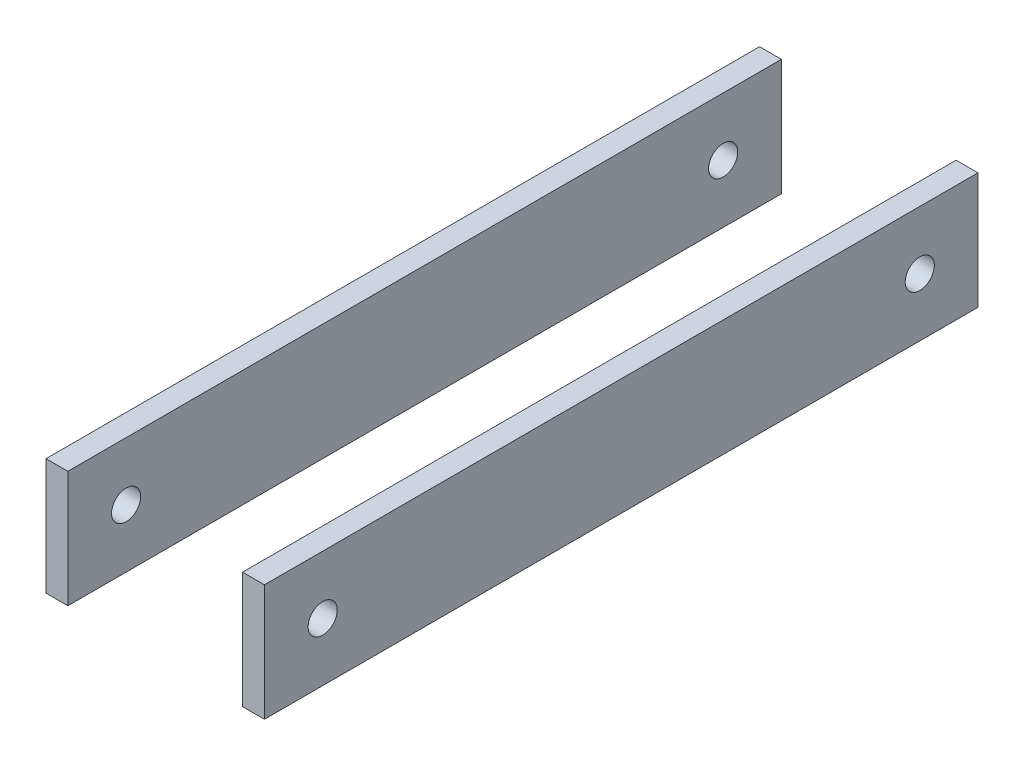
ISO-10303-21;
HEADER;
FILE_DESCRIPTION(('STEP AP214'),'2;1');
FILE_NAME('part.step','',(''),(''),'','','');
FILE_SCHEMA(('AUTOMOTIVE_DESIGN { 1 0 10303 214 1 1 1 1 }'));
ENDSEC;
DATA;
#1=APPLICATION_CONTEXT('core data for automotive mechanical design processes');
#2=APPLICATION_PROTOCOL_DEFINITION('international standard','automotive_design',2000,#1);
#3=PRODUCT_CONTEXT('',#1,'mechanical');
#4=PRODUCT('Part','Part','',(#3));
#5=PRODUCT_RELATED_PRODUCT_CATEGORY('part','',(#4));
#6=PRODUCT_DEFINITION_FORMATION('','',#4);
#7=PRODUCT_DEFINITION_CONTEXT('part definition',#1,'design');
#8=PRODUCT_DEFINITION('design','',#6,#7);
#9=PRODUCT_DEFINITION_SHAPE('','',#8);
#10=(LENGTH_UNIT() NAMED_UNIT(*) SI_UNIT(.MILLI.,.METRE.));
#11=(NAMED_UNIT(*) PLANE_ANGLE_UNIT() SI_UNIT($,.RADIAN.));
#12=(NAMED_UNIT(*) SI_UNIT($,.STERADIAN.) SOLID_ANGLE_UNIT());
#13=UNCERTAINTY_MEASURE_WITH_UNIT(LENGTH_MEASURE(1.E-05),#10,'distance_accuracy_value','');
#14=(GEOMETRIC_REPRESENTATION_CONTEXT(3) GLOBAL_UNCERTAINTY_ASSIGNED_CONTEXT((#13)) GLOBAL_UNIT_ASSIGNED_CONTEXT((#10,
#11,#12)) REPRESENTATION_CONTEXT('',''));
#15=CARTESIAN_POINT('',(0.,0.,0.));
#16=DIRECTION('',(0.,0.,1.));
#17=DIRECTION('',(1.,0.,0.));
#18=AXIS2_PLACEMENT_3D('',#15,#16,#17);
#19=CARTESIAN_POINT('',(47.625,25.4,152.4));
#20=DIRECTION('',(0.,0.,-1.));
#21=DIRECTION('',(-1.,0.,0.));
#22=AXIS2_PLACEMENT_3D('',#19,#20,#21);
#23=PLANE('',#22);
#24=DIRECTION('',(-1.,0.,0.));
#25=VECTOR('',#24,1.);
#26=CARTESIAN_POINT('',(47.625,-25.4,152.4));
#27=LINE('',#26,#25);
#28=CARTESIAN_POINT('',(-38.1,-25.4,152.4));
#29=VERTEX_POINT('',#28);
#30=CARTESIAN_POINT('',(-47.625,-25.4,152.4));
#31=VERTEX_POINT('',#30);
#32=EDGE_CURVE('E101',#29,#31,#27,.T.);
#33=ORIENTED_EDGE('',*,*,#32,.F.);
#34=DIRECTION('',(0.,-1.,0.));
#35=VECTOR('',#34,1.);
#36=CARTESIAN_POINT('',(-38.1,25.4,152.4));
#37=LINE('',#36,#35);
#38=CARTESIAN_POINT('',(-38.1,25.4,152.4));
#39=VERTEX_POINT('',#38);
#40=EDGE_CURVE('E65',#39,#29,#37,.T.);
#41=ORIENTED_EDGE('',*,*,#40,.F.);
#42=DIRECTION('',(-1.,0.,0.));
#43=VECTOR('',#42,1.);
#44=CARTESIAN_POINT('',(47.625,25.4,152.4));
#45=LINE('',#44,#43);
#46=CARTESIAN_POINT('',(-47.625,25.4,152.4));
#47=VERTEX_POINT('',#46);
#48=EDGE_CURVE('E59',#39,#47,#45,.T.);
#49=ORIENTED_EDGE('',*,*,#48,.T.);
#50=DIRECTION('',(0.,-1.,0.));
#51=VECTOR('',#50,1.);
#52=CARTESIAN_POINT('',(-47.625,25.4,152.4));
#53=LINE('',#52,#51);
#54=EDGE_CURVE('E114',#47,#31,#53,.T.);
#55=ORIENTED_EDGE('',*,*,#54,.T.);
#56=EDGE_LOOP('',(#33,#41,#49,#55));
#57=FACE_BOUND('',#56,.T.);
#58=ADVANCED_FACE('F55',(#57),#23,.F.);
#59=CARTESIAN_POINT('',(47.625,-25.4,152.4));
#60=DIRECTION('',(0.,1.,0.));
#61=DIRECTION('',(0.,0.,1.));
#62=AXIS2_PLACEMENT_3D('',#59,#60,#61);
#63=PLANE('',#62);
#64=DIRECTION('',(-1.,0.,0.));
#65=VECTOR('',#64,1.);
#66=CARTESIAN_POINT('',(47.625,-25.4,-158.75));
#67=LINE('',#66,#65);
#68=CARTESIAN_POINT('',(-38.1,-25.4,-158.75));
#69=VERTEX_POINT('',#68);
#70=CARTESIAN_POINT('',(-47.625,-25.4,-158.75));
#71=VERTEX_POINT('',#70);
#72=EDGE_CURVE('E135',#69,#71,#67,.T.);
#73=ORIENTED_EDGE('',*,*,#72,.F.);
#74=DIRECTION('',(0.,0.,1.));
#75=VECTOR('',#74,1.);
#76=CARTESIAN_POINT('',(-38.1,-25.4,-158.75));
#77=LINE('',#76,#75);
#78=EDGE_CURVE('E107',#69,#29,#77,.T.);
#79=ORIENTED_EDGE('',*,*,#78,.T.);
#80=ORIENTED_EDGE('',*,*,#32,.T.);
#81=DIRECTION('',(0.,0.,-1.));
#82=VECTOR('',#81,1.);
#83=CARTESIAN_POINT('',(-47.625,-25.4,152.4));
#84=LINE('',#83,#82);
#85=EDGE_CURVE('E105',#31,#71,#84,.T.);
#86=ORIENTED_EDGE('',*,*,#85,.T.);
#87=EDGE_LOOP('',(#73,#79,#80,#86));
#88=FACE_BOUND('',#87,.T.);
#89=ADVANCED_FACE('F104',(#88),#63,.F.);
#90=CARTESIAN_POINT('',(47.625,25.4,-158.75));
#91=DIRECTION('',(0.,0.,1.));
#92=DIRECTION('',(1.,0.,0.));
#93=AXIS2_PLACEMENT_3D('',#90,#91,#92);
#94=PLANE('',#93);
#95=DIRECTION('',(-1.,0.,0.));
#96=VECTOR('',#95,1.);
#97=CARTESIAN_POINT('',(47.625,25.4,-158.75));
#98=LINE('',#97,#96);
#99=CARTESIAN_POINT('',(-38.1,25.4,-158.75));
#100=VERTEX_POINT('',#99);
#101=CARTESIAN_POINT('',(-47.625,25.4,-158.75));
#102=VERTEX_POINT('',#101);
#103=EDGE_CURVE('E88',#100,#102,#98,.T.);
#104=ORIENTED_EDGE('',*,*,#103,.F.);
#105=DIRECTION('',(0.,-1.,0.));
#106=VECTOR('',#105,1.);
#107=CARTESIAN_POINT('',(-38.1,25.4,-158.75));
#108=LINE('',#107,#106);
#109=EDGE_CURVE('E116',#100,#69,#108,.T.);
#110=ORIENTED_EDGE('',*,*,#109,.T.);
#111=ORIENTED_EDGE('',*,*,#72,.T.);
#112=DIRECTION('',(0.,1.,0.));
#113=VECTOR('',#112,1.);
#114=CARTESIAN_POINT('',(-47.625,25.4,-158.75));
#115=LINE('',#114,#113);
#116=EDGE_CURVE('E115',#71,#102,#115,.T.);
#117=ORIENTED_EDGE('',*,*,#116,.T.);
#118=EDGE_LOOP('',(#104,#110,#111,#117));
#119=FACE_BOUND('',#118,.T.);
#120=ADVANCED_FACE('F162',(#119),#94,.F.);
#121=CARTESIAN_POINT('',(47.625,25.4,152.4));
#122=DIRECTION('',(0.,-1.,0.));
#123=DIRECTION('',(0.,0.,-1.));
#124=AXIS2_PLACEMENT_3D('',#121,#122,#123);
#125=PLANE('',#124);
#126=ORIENTED_EDGE('',*,*,#48,.F.);
#127=DIRECTION('',(0.,0.,1.));
#128=VECTOR('',#127,1.);
#129=CARTESIAN_POINT('',(-38.1,25.4,-158.75));
#130=LINE('',#129,#128);
#131=EDGE_CURVE('E12',#100,#39,#130,.T.);
#132=ORIENTED_EDGE('',*,*,#131,.F.);
#133=ORIENTED_EDGE('',*,*,#103,.T.);
#134=DIRECTION('',(0.,0.,1.));
#135=VECTOR('',#134,1.);
#136=CARTESIAN_POINT('',(-47.625,25.4,152.4));
#137=LINE('',#136,#135);
#138=EDGE_CURVE('E126',#102,#47,#137,.T.);
#139=ORIENTED_EDGE('',*,*,#138,.T.);
#140=EDGE_LOOP('',(#126,#132,#133,#139));
#141=FACE_BOUND('',#140,.T.);
#142=ADVANCED_FACE('F166',(#141),#125,.F.);
#143=CARTESIAN_POINT('',(47.625,0.,127.));
#144=DIRECTION('',(-1.,0.,0.));
#145=DIRECTION('',(0.,0.,1.));
#146=AXIS2_PLACEMENT_3D('',#143,#144,#145);
#147=CYLINDRICAL_SURFACE('',#146,6.35);
#148=CARTESIAN_POINT('',(-38.1,0.,127.));
#149=DIRECTION('',(-1.,0.,0.));
#150=DIRECTION('',(0.,-1.,0.));
#151=AXIS2_PLACEMENT_3D('',#148,#149,#150);
#152=CIRCLE('',#151,6.35);
#153=CARTESIAN_POINT('',(-38.1,-6.35,127.));
#154=VERTEX_POINT('',#153);
#155=EDGE_CURVE('E129',#154,#154,#152,.T.);
#156=ORIENTED_EDGE('',*,*,#155,.F.);
#157=EDGE_LOOP('',(#156));
#158=FACE_BOUND('',#157,.T.);
#159=CARTESIAN_POINT('',(-47.625,0.,127.));
#160=DIRECTION('',(1.,0.,0.));
#161=DIRECTION('',(0.,0.,-1.));
#162=AXIS2_PLACEMENT_3D('',#159,#160,#161);
#163=CIRCLE('',#162,6.35);
#164=CARTESIAN_POINT('',(-47.625,0.,120.65));
#165=VERTEX_POINT('',#164);
#166=EDGE_CURVE('E122',#165,#165,#163,.T.);
#167=ORIENTED_EDGE('',*,*,#166,.F.);
#168=EDGE_LOOP('',(#167));
#169=FACE_BOUND('',#168,.T.);
#170=ADVANCED_FACE('F147',(#158,#169),#147,.F.);
#171=CARTESIAN_POINT('',(47.625,0.,-133.35));
#172=DIRECTION('',(-1.,0.,0.));
#173=DIRECTION('',(0.,0.,1.));
#174=AXIS2_PLACEMENT_3D('',#171,#172,#173);
#175=CYLINDRICAL_SURFACE('',#174,6.35);
#176=CARTESIAN_POINT('',(-38.1,0.,-133.35));
#177=DIRECTION('',(-1.,0.,0.));
#178=DIRECTION('',(0.,-1.,0.));
#179=AXIS2_PLACEMENT_3D('',#176,#177,#178);
#180=CIRCLE('',#179,6.35);
#181=CARTESIAN_POINT('',(-38.1,-6.35,-133.35));
#182=VERTEX_POINT('',#181);
#183=EDGE_CURVE('E131',#182,#182,#180,.T.);
#184=ORIENTED_EDGE('',*,*,#183,.F.);
#185=EDGE_LOOP('',(#184));
#186=FACE_BOUND('',#185,.T.);
#187=CARTESIAN_POINT('',(-47.625,0.,-133.35));
#188=DIRECTION('',(1.,0.,0.));
#189=DIRECTION('',(0.,0.,-1.));
#190=AXIS2_PLACEMENT_3D('',#187,#188,#189);
#191=CIRCLE('',#190,6.35);
#192=CARTESIAN_POINT('',(-47.625,0.,-139.7));
#193=VERTEX_POINT('',#192);
#194=EDGE_CURVE('E125',#193,#193,#191,.T.);
#195=ORIENTED_EDGE('',*,*,#194,.F.);
#196=EDGE_LOOP('',(#195));
#197=FACE_BOUND('',#196,.T.);
#198=ADVANCED_FACE('F57',(#186,#197),#175,.F.);
#199=CARTESIAN_POINT('',(-47.625,0.,0.));
#200=DIRECTION('',(1.,0.,0.));
#201=DIRECTION('',(0.,0.,-1.));
#202=AXIS2_PLACEMENT_3D('',#199,#200,#201);
#203=PLANE('',#202);
#204=ORIENTED_EDGE('',*,*,#54,.F.);
#205=ORIENTED_EDGE('',*,*,#138,.F.);
#206=ORIENTED_EDGE('',*,*,#116,.F.);
#207=ORIENTED_EDGE('',*,*,#85,.F.);
#208=EDGE_LOOP('',(#204,#205,#206,#207));
#209=FACE_BOUND('',#208,.T.);
#210=ORIENTED_EDGE('',*,*,#166,.T.);
#211=EDGE_LOOP('',(#210));
#212=FACE_BOUND('',#211,.T.);
#213=ORIENTED_EDGE('',*,*,#194,.T.);
#214=EDGE_LOOP('',(#213));
#215=FACE_BOUND('',#214,.T.);
#216=ADVANCED_FACE('F111',(#209,#212,#215),#203,.F.);
#217=CARTESIAN_POINT('',(-38.1,25.4,-158.75));
#218=DIRECTION('',(-1.,0.,0.));
#219=DIRECTION('',(0.,-1.,0.));
#220=AXIS2_PLACEMENT_3D('',#217,#218,#219);
#221=PLANE('',#220);
#222=ORIENTED_EDGE('',*,*,#155,.T.);
#223=EDGE_LOOP('',(#222));
#224=FACE_BOUND('',#223,.T.);
#225=ORIENTED_EDGE('',*,*,#183,.T.);
#226=EDGE_LOOP('',(#225));
#227=FACE_BOUND('',#226,.T.);
#228=ORIENTED_EDGE('',*,*,#40,.T.);
#229=ORIENTED_EDGE('',*,*,#78,.F.);
#230=ORIENTED_EDGE('',*,*,#109,.F.);
#231=ORIENTED_EDGE('',*,*,#131,.T.);
#232=EDGE_LOOP('',(#228,#229,#230,#231));
#233=FACE_BOUND('',#232,.T.);
#234=ADVANCED_FACE('F143',(#224,#227,#233),#221,.F.);
#235=CLOSED_SHELL('',(#58,#89,#120,#142,#170,#198,#216,#234));
#236=MANIFOLD_SOLID_BREP('B2',#235);
#237=CARTESIAN_POINT('',(47.625,25.4,152.4));
#238=DIRECTION('',(0.,-1.,0.));
#239=DIRECTION('',(0.,0.,-1.));
#240=AXIS2_PLACEMENT_3D('',#237,#238,#239);
#241=PLANE('',#240);
#242=DIRECTION('',(-1.,0.,0.));
#243=VECTOR('',#242,1.);
#244=CARTESIAN_POINT('',(47.625,25.4,-158.75));
#245=LINE('',#244,#243);
#246=CARTESIAN_POINT('',(47.625,25.4,-158.75));
#247=VERTEX_POINT('',#246);
#248=CARTESIAN_POINT('',(38.1,25.4,-158.75));
#249=VERTEX_POINT('',#248);
#250=EDGE_CURVE('E284',#247,#249,#245,.T.);
#251=ORIENTED_EDGE('',*,*,#250,.T.);
#252=DIRECTION('',(0.,0.,1.));
#253=VECTOR('',#252,1.);
#254=CARTESIAN_POINT('',(38.1,25.4,-158.75));
#255=LINE('',#254,#253);
#256=CARTESIAN_POINT('',(38.1,25.4,152.4));
#257=VERTEX_POINT('',#256);
#258=EDGE_CURVE('E267',#249,#257,#255,.T.);
#259=ORIENTED_EDGE('',*,*,#258,.T.);
#260=DIRECTION('',(-1.,0.,0.));
#261=VECTOR('',#260,1.);
#262=CARTESIAN_POINT('',(47.625,25.4,152.4));
#263=LINE('',#262,#261);
#264=CARTESIAN_POINT('',(47.625,25.4,152.4));
#265=VERTEX_POINT('',#264);
#266=EDGE_CURVE('E287',#265,#257,#263,.T.);
#267=ORIENTED_EDGE('',*,*,#266,.F.);
#268=DIRECTION('',(0.,0.,1.));
#269=VECTOR('',#268,1.);
#270=CARTESIAN_POINT('',(47.625,25.4,152.4));
#271=LINE('',#270,#269);
#272=EDGE_CURVE('E246',#247,#265,#271,.T.);
#273=ORIENTED_EDGE('',*,*,#272,.F.);
#274=EDGE_LOOP('',(#251,#259,#267,#273));
#275=FACE_BOUND('',#274,.T.);
#276=ADVANCED_FACE('F221',(#275),#241,.F.);
#277=CARTESIAN_POINT('',(47.625,25.4,-158.75));
#278=DIRECTION('',(0.,0.,1.));
#279=DIRECTION('',(1.,0.,0.));
#280=AXIS2_PLACEMENT_3D('',#277,#278,#279);
#281=PLANE('',#280);
#282=DIRECTION('',(-1.,0.,0.));
#283=VECTOR('',#282,1.);
#284=CARTESIAN_POINT('',(47.625,-25.4,-158.75));
#285=LINE('',#284,#283);
#286=CARTESIAN_POINT('',(47.625,-25.4,-158.75));
#287=VERTEX_POINT('',#286);
#288=CARTESIAN_POINT('',(38.1,-25.4,-158.75));
#289=VERTEX_POINT('',#288);
#290=EDGE_CURVE('E231',#287,#289,#285,.T.);
#291=ORIENTED_EDGE('',*,*,#290,.T.);
#292=DIRECTION('',(0.,1.,0.));
#293=VECTOR('',#292,1.);
#294=CARTESIAN_POINT('',(38.1,25.4,-158.75));
#295=LINE('',#294,#293);
#296=EDGE_CURVE('E263',#289,#249,#295,.T.);
#297=ORIENTED_EDGE('',*,*,#296,.T.);
#298=ORIENTED_EDGE('',*,*,#250,.F.);
#299=DIRECTION('',(0.,1.,0.));
#300=VECTOR('',#299,1.);
#301=CARTESIAN_POINT('',(47.625,25.4,-158.75));
#302=LINE('',#301,#300);
#303=EDGE_CURVE('E282',#287,#247,#302,.T.);
#304=ORIENTED_EDGE('',*,*,#303,.F.);
#305=EDGE_LOOP('',(#291,#297,#298,#304));
#306=FACE_BOUND('',#305,.T.);
#307=ADVANCED_FACE('F281',(#306),#281,.F.);
#308=CARTESIAN_POINT('',(47.625,-25.4,152.4));
#309=DIRECTION('',(0.,1.,0.));
#310=DIRECTION('',(0.,0.,1.));
#311=AXIS2_PLACEMENT_3D('',#308,#309,#310);
#312=PLANE('',#311);
#313=DIRECTION('',(-1.,0.,0.));
#314=VECTOR('',#313,1.);
#315=CARTESIAN_POINT('',(47.625,-25.4,152.4));
#316=LINE('',#315,#314);
#317=CARTESIAN_POINT('',(47.625,-25.4,152.4));
#318=VERTEX_POINT('',#317);
#319=CARTESIAN_POINT('',(38.1,-25.4,152.4));
#320=VERTEX_POINT('',#319);
#321=EDGE_CURVE('E53',#318,#320,#316,.T.);
#322=ORIENTED_EDGE('',*,*,#321,.T.);
#323=DIRECTION('',(0.,0.,1.));
#324=VECTOR('',#323,1.);
#325=CARTESIAN_POINT('',(38.1,-25.4,-158.75));
#326=LINE('',#325,#324);
#327=EDGE_CURVE('E266',#289,#320,#326,.T.);
#328=ORIENTED_EDGE('',*,*,#327,.F.);
#329=ORIENTED_EDGE('',*,*,#290,.F.);
#330=DIRECTION('',(0.,0.,-1.));
#331=VECTOR('',#330,1.);
#332=CARTESIAN_POINT('',(47.625,-25.4,152.4));
#333=LINE('',#332,#331);
#334=EDGE_CURVE('E297',#318,#287,#333,.T.);
#335=ORIENTED_EDGE('',*,*,#334,.F.);
#336=EDGE_LOOP('',(#322,#328,#329,#335));
#337=FACE_BOUND('',#336,.T.);
#338=ADVANCED_FACE('F276',(#337),#312,.F.);
#339=CARTESIAN_POINT('',(47.625,25.4,152.4));
#340=DIRECTION('',(0.,0.,-1.));
#341=DIRECTION('',(-1.,0.,0.));
#342=AXIS2_PLACEMENT_3D('',#339,#340,#341);
#343=PLANE('',#342);
#344=ORIENTED_EDGE('',*,*,#266,.T.);
#345=DIRECTION('',(0.,1.,0.));
#346=VECTOR('',#345,1.);
#347=CARTESIAN_POINT('',(38.1,25.4,152.4));
#348=LINE('',#347,#346);
#349=EDGE_CURVE('E238',#320,#257,#348,.T.);
#350=ORIENTED_EDGE('',*,*,#349,.F.);
#351=ORIENTED_EDGE('',*,*,#321,.F.);
#352=DIRECTION('',(0.,-1.,0.));
#353=VECTOR('',#352,1.);
#354=CARTESIAN_POINT('',(47.625,25.4,152.4));
#355=LINE('',#354,#353);
#356=EDGE_CURVE('E300',#265,#318,#355,.T.);
#357=ORIENTED_EDGE('',*,*,#356,.F.);
#358=EDGE_LOOP('',(#344,#350,#351,#357));
#359=FACE_BOUND('',#358,.T.);
#360=ADVANCED_FACE('F223',(#359),#343,.F.);
#361=CARTESIAN_POINT('',(47.625,0.,127.));
#362=DIRECTION('',(-1.,0.,0.));
#363=DIRECTION('',(0.,0.,1.));
#364=AXIS2_PLACEMENT_3D('',#361,#362,#363);
#365=CYLINDRICAL_SURFACE('',#364,6.35);
#366=CARTESIAN_POINT('',(38.1,0.,127.));
#367=DIRECTION('',(1.,0.,0.));
#368=DIRECTION('',(0.,1.,0.));
#369=AXIS2_PLACEMENT_3D('',#366,#367,#368);
#370=CIRCLE('',#369,6.35);
#371=CARTESIAN_POINT('',(38.1,6.35,127.));
#372=VERTEX_POINT('',#371);
#373=EDGE_CURVE('E311',#372,#372,#370,.T.);
#374=ORIENTED_EDGE('',*,*,#373,.F.);
#375=EDGE_LOOP('',(#374));
#376=FACE_BOUND('',#375,.T.);
#377=CARTESIAN_POINT('',(47.625,0.,127.));
#378=DIRECTION('',(1.,0.,0.));
#379=DIRECTION('',(0.,0.,-1.));
#380=AXIS2_PLACEMENT_3D('',#377,#378,#379);
#381=CIRCLE('',#380,6.35);
#382=CARTESIAN_POINT('',(47.625,0.,120.65));
#383=VERTEX_POINT('',#382);
#384=EDGE_CURVE('E303',#383,#383,#381,.T.);
#385=ORIENTED_EDGE('',*,*,#384,.T.);
#386=EDGE_LOOP('',(#385));
#387=FACE_BOUND('',#386,.T.);
#388=ADVANCED_FACE('F331',(#376,#387),#365,.F.);
#389=CARTESIAN_POINT('',(47.625,0.,0.));
#390=DIRECTION('',(1.,0.,0.));
#391=DIRECTION('',(0.,0.,-1.));
#392=AXIS2_PLACEMENT_3D('',#389,#390,#391);
#393=PLANE('',#392);
#394=ORIENTED_EDGE('',*,*,#384,.F.);
#395=EDGE_LOOP('',(#394));
#396=FACE_BOUND('',#395,.T.);
#397=ORIENTED_EDGE('',*,*,#356,.T.);
#398=ORIENTED_EDGE('',*,*,#334,.T.);
#399=ORIENTED_EDGE('',*,*,#303,.T.);
#400=ORIENTED_EDGE('',*,*,#272,.T.);
#401=EDGE_LOOP('',(#397,#398,#399,#400));
#402=FACE_BOUND('',#401,.T.);
#403=CARTESIAN_POINT('',(47.625,0.,-133.35));
#404=DIRECTION('',(1.,0.,0.));
#405=DIRECTION('',(0.,0.,-1.));
#406=AXIS2_PLACEMENT_3D('',#403,#404,#405);
#407=CIRCLE('',#406,6.35);
#408=CARTESIAN_POINT('',(47.625,0.,-139.7));
#409=VERTEX_POINT('',#408);
#410=EDGE_CURVE('E307',#409,#409,#407,.T.);
#411=ORIENTED_EDGE('',*,*,#410,.F.);
#412=EDGE_LOOP('',(#411));
#413=FACE_BOUND('',#412,.T.);
#414=ADVANCED_FACE('F326',(#396,#402,#413),#393,.T.);
#415=CARTESIAN_POINT('',(47.625,0.,-133.35));
#416=DIRECTION('',(-1.,0.,0.));
#417=DIRECTION('',(0.,0.,1.));
#418=AXIS2_PLACEMENT_3D('',#415,#416,#417);
#419=CYLINDRICAL_SURFACE('',#418,6.35);
#420=CARTESIAN_POINT('',(38.1,0.,-133.35));
#421=DIRECTION('',(1.,0.,0.));
#422=DIRECTION('',(0.,1.,0.));
#423=AXIS2_PLACEMENT_3D('',#420,#421,#422);
#424=CIRCLE('',#423,6.35);
#425=CARTESIAN_POINT('',(38.1,6.35,-133.35));
#426=VERTEX_POINT('',#425);
#427=EDGE_CURVE('E225',#426,#426,#424,.T.);
#428=ORIENTED_EDGE('',*,*,#427,.F.);
#429=EDGE_LOOP('',(#428));
#430=FACE_BOUND('',#429,.T.);
#431=ORIENTED_EDGE('',*,*,#410,.T.);
#432=EDGE_LOOP('',(#431));
#433=FACE_BOUND('',#432,.T.);
#434=ADVANCED_FACE('F323',(#430,#433),#419,.F.);
#435=CARTESIAN_POINT('',(38.1,25.4,-158.75));
#436=DIRECTION('',(1.,0.,0.));
#437=DIRECTION('',(0.,1.,0.));
#438=AXIS2_PLACEMENT_3D('',#435,#436,#437);
#439=PLANE('',#438);
#440=ORIENTED_EDGE('',*,*,#373,.T.);
#441=EDGE_LOOP('',(#440));
#442=FACE_BOUND('',#441,.T.);
#443=ORIENTED_EDGE('',*,*,#427,.T.);
#444=EDGE_LOOP('',(#443));
#445=FACE_BOUND('',#444,.T.);
#446=ORIENTED_EDGE('',*,*,#349,.T.);
#447=ORIENTED_EDGE('',*,*,#258,.F.);
#448=ORIENTED_EDGE('',*,*,#296,.F.);
#449=ORIENTED_EDGE('',*,*,#327,.T.);
#450=EDGE_LOOP('',(#446,#447,#448,#449));
#451=FACE_BOUND('',#450,.T.);
#452=ADVANCED_FACE('F265',(#442,#445,#451),#439,.F.);
#453=CLOSED_SHELL('',(#276,#307,#338,#360,#388,#414,#434,#452));
#454=MANIFOLD_SOLID_BREP('B6',#453);
#455=ADVANCED_BREP_SHAPE_REPRESENTATION('',(#18,#236,#454),#14);
#456=SHAPE_DEFINITION_REPRESENTATION(#9,#455);
ENDSEC;
END-ISO-10303-21;
